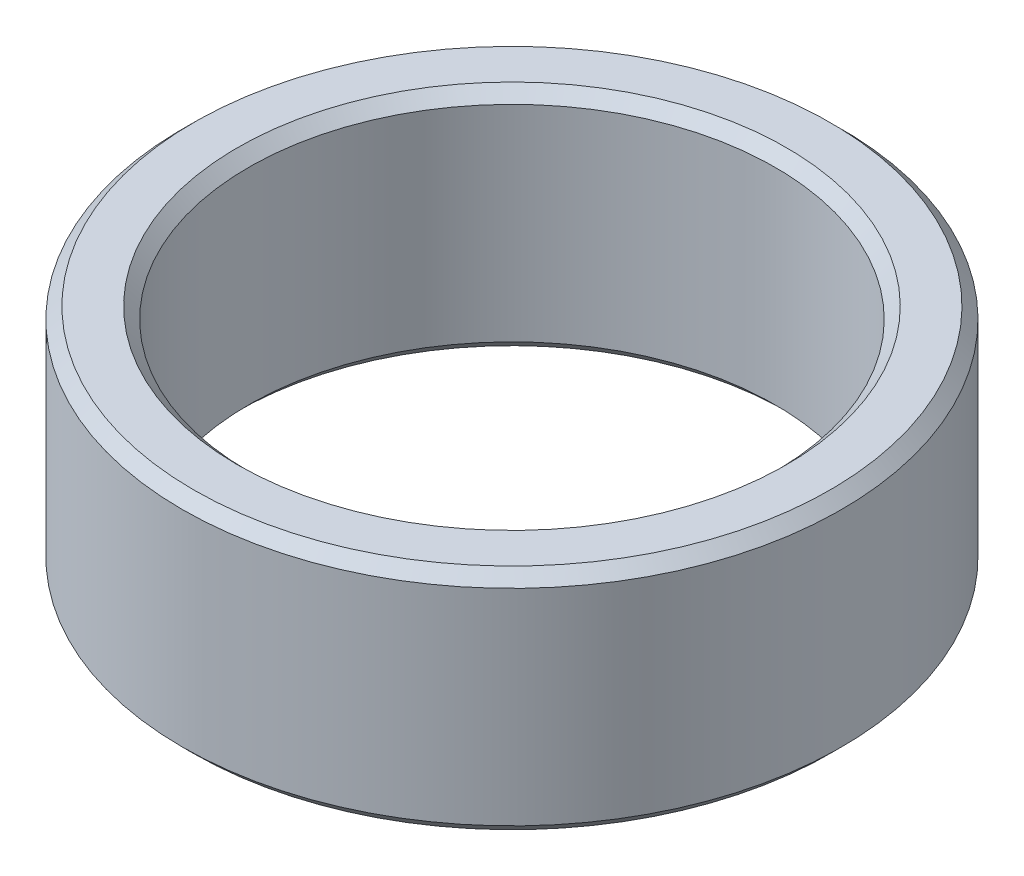
ISO-10303-21;
HEADER;
FILE_DESCRIPTION(('STEP AP214'),'2;1');
FILE_NAME('part.step','',(''),(''),'','','');
FILE_SCHEMA(('AUTOMOTIVE_DESIGN { 1 0 10303 214 1 1 1 1 }'));
ENDSEC;
DATA;
#1=APPLICATION_CONTEXT('core data for automotive mechanical design processes');
#2=APPLICATION_PROTOCOL_DEFINITION('international standard','automotive_design',2000,#1);
#3=PRODUCT_CONTEXT('',#1,'mechanical');
#4=PRODUCT('Part','Part','',(#3));
#5=PRODUCT_RELATED_PRODUCT_CATEGORY('part','',(#4));
#6=PRODUCT_DEFINITION_FORMATION('','',#4);
#7=PRODUCT_DEFINITION_CONTEXT('part definition',#1,'design');
#8=PRODUCT_DEFINITION('design','',#6,#7);
#9=PRODUCT_DEFINITION_SHAPE('','',#8);
#10=(LENGTH_UNIT() NAMED_UNIT(*) SI_UNIT(.MILLI.,.METRE.));
#11=(NAMED_UNIT(*) PLANE_ANGLE_UNIT() SI_UNIT($,.RADIAN.));
#12=(NAMED_UNIT(*) SI_UNIT($,.STERADIAN.) SOLID_ANGLE_UNIT());
#13=UNCERTAINTY_MEASURE_WITH_UNIT(LENGTH_MEASURE(1.E-05),#10,'distance_accuracy_value','');
#14=(GEOMETRIC_REPRESENTATION_CONTEXT(3) GLOBAL_UNCERTAINTY_ASSIGNED_CONTEXT((#13)) GLOBAL_UNIT_ASSIGNED_CONTEXT((#10,
#11,#12)) REPRESENTATION_CONTEXT('',''));
#15=CARTESIAN_POINT('',(0.,0.,0.));
#16=DIRECTION('',(0.,0.,1.));
#17=DIRECTION('',(1.,0.,0.));
#18=AXIS2_PLACEMENT_3D('',#15,#16,#17);
#19=CARTESIAN_POINT('',(0.,34.6418154379135,0.));
#20=DIRECTION('',(0.,-1.,0.));
#21=DIRECTION('',(0.,0.,-1.));
#22=AXIS2_PLACEMENT_3D('',#19,#20,#21);
#23=CYLINDRICAL_SURFACE('',#22,50.);
#24=CARTESIAN_POINT('',(0.,1.71874380042932,0.));
#25=DIRECTION('',(0.,1.,0.));
#26=DIRECTION('',(0.,0.,1.));
#27=AXIS2_PLACEMENT_3D('',#24,#25,#26);
#28=CIRCLE('',#27,50.);
#29=CARTESIAN_POINT('',(0.,1.71874380042932,50.));
#30=VERTEX_POINT('',#29);
#31=EDGE_CURVE('E10',#30,#30,#28,.T.);
#32=ORIENTED_EDGE('',*,*,#31,.T.);
#33=EDGE_LOOP('',(#32));
#34=FACE_BOUND('',#33,.T.);
#35=CARTESIAN_POINT('',(0.,32.9230716374841,0.));
#36=DIRECTION('',(0.,1.,0.));
#37=DIRECTION('',(0.,0.,1.));
#38=AXIS2_PLACEMENT_3D('',#35,#36,#37);
#39=CIRCLE('',#38,50.);
#40=CARTESIAN_POINT('',(0.,32.9230716374841,50.));
#41=VERTEX_POINT('',#40);
#42=EDGE_CURVE('E50',#41,#41,#39,.F.);
#43=ORIENTED_EDGE('',*,*,#42,.T.);
#44=EDGE_LOOP('',(#43));
#45=FACE_BOUND('',#44,.T.);
#46=ADVANCED_FACE('F39',(#34,#45),#23,.T.);
#47=CARTESIAN_POINT('',(0.,34.6418154379135,0.));
#48=DIRECTION('',(0.,1.,0.));
#49=DIRECTION('',(0.,0.,1.));
#50=AXIS2_PLACEMENT_3D('',#47,#48,#49);
#51=PLANE('',#50);
#52=CARTESIAN_POINT('',(0.,34.6418154379135,0.));
#53=DIRECTION('',(0.,1.,0.));
#54=DIRECTION('',(0.,0.,1.));
#55=AXIS2_PLACEMENT_3D('',#52,#53,#54);
#56=CIRCLE('',#55,41.6600283417874);
#57=CARTESIAN_POINT('',(0.,34.6418154379135,41.6600283417874));
#58=VERTEX_POINT('',#57);
#59=EDGE_CURVE('E58',#58,#58,#56,.F.);
#60=ORIENTED_EDGE('',*,*,#59,.T.);
#61=EDGE_LOOP('',(#60));
#62=FACE_BOUND('',#61,.T.);
#63=CARTESIAN_POINT('',(0.,34.6418154379135,0.));
#64=DIRECTION('',(0.,1.,0.));
#65=DIRECTION('',(0.,0.,1.));
#66=AXIS2_PLACEMENT_3D('',#63,#64,#65);
#67=CIRCLE('',#66,48.2812561995706);
#68=CARTESIAN_POINT('',(0.,34.6418154379135,48.2812561995706));
#69=VERTEX_POINT('',#68);
#70=EDGE_CURVE('E61',#69,#69,#67,.T.);
#71=ORIENTED_EDGE('',*,*,#70,.T.);
#72=EDGE_LOOP('',(#71));
#73=FACE_BOUND('',#72,.T.);
#74=ADVANCED_FACE('F88',(#62,#73),#51,.T.);
#75=CARTESIAN_POINT('',(0.,0.,0.));
#76=DIRECTION('',(0.,1.,0.));
#77=DIRECTION('',(0.,0.,1.));
#78=AXIS2_PLACEMENT_3D('',#75,#76,#77);
#79=PLANE('',#78);
#80=CARTESIAN_POINT('',(0.,0.,0.));
#81=DIRECTION('',(0.,1.,0.));
#82=DIRECTION('',(0.,0.,1.));
#83=AXIS2_PLACEMENT_3D('',#80,#81,#82);
#84=CIRCLE('',#83,41.6600283417873);
#85=CARTESIAN_POINT('',(0.,0.,41.6600283417873));
#86=VERTEX_POINT('',#85);
#87=EDGE_CURVE('E51',#86,#86,#84,.T.);
#88=ORIENTED_EDGE('',*,*,#87,.T.);
#89=EDGE_LOOP('',(#88));
#90=FACE_BOUND('',#89,.T.);
#91=CARTESIAN_POINT('',(0.,0.,0.));
#92=DIRECTION('',(0.,1.,0.));
#93=DIRECTION('',(0.,0.,1.));
#94=AXIS2_PLACEMENT_3D('',#91,#92,#93);
#95=CIRCLE('',#94,48.2812561995707);
#96=CARTESIAN_POINT('',(0.,0.,48.2812561995707));
#97=VERTEX_POINT('',#96);
#98=EDGE_CURVE('E54',#97,#97,#95,.F.);
#99=ORIENTED_EDGE('',*,*,#98,.T.);
#100=EDGE_LOOP('',(#99));
#101=FACE_BOUND('',#100,.T.);
#102=ADVANCED_FACE('F83',(#90,#101),#79,.F.);
#103=CARTESIAN_POINT('',(0.,34.6418154379135,0.));
#104=DIRECTION('',(0.,-1.,0.));
#105=DIRECTION('',(0.,0.,-1.));
#106=AXIS2_PLACEMENT_3D('',#103,#104,#105);
#107=CYLINDRICAL_SURFACE('',#106,39.9412845413579);
#108=CARTESIAN_POINT('',(0.,32.9230716374841,0.));
#109=DIRECTION('',(0.,1.,0.));
#110=DIRECTION('',(0.,0.,1.));
#111=AXIS2_PLACEMENT_3D('',#108,#109,#110);
#112=CIRCLE('',#111,39.9412845413579);
#113=CARTESIAN_POINT('',(0.,32.9230716374841,39.9412845413579));
#114=VERTEX_POINT('',#113);
#115=EDGE_CURVE('E67',#114,#114,#112,.T.);
#116=ORIENTED_EDGE('',*,*,#115,.T.);
#117=EDGE_LOOP('',(#116));
#118=FACE_BOUND('',#117,.T.);
#119=CARTESIAN_POINT('',(0.,1.71874380042935,0.));
#120=DIRECTION('',(0.,1.,0.));
#121=DIRECTION('',(0.,0.,1.));
#122=AXIS2_PLACEMENT_3D('',#119,#120,#121);
#123=CIRCLE('',#122,39.9412845413579);
#124=CARTESIAN_POINT('',(0.,1.71874380042935,39.9412845413579));
#125=VERTEX_POINT('',#124);
#126=EDGE_CURVE('E69',#125,#125,#123,.F.);
#127=ORIENTED_EDGE('',*,*,#126,.T.);
#128=EDGE_LOOP('',(#127));
#129=FACE_BOUND('',#128,.T.);
#130=ADVANCED_FACE('F71',(#118,#129),#107,.F.);
#131=CARTESIAN_POINT('',(0.,32.9230716374841,0.));
#132=DIRECTION('',(0.,1.,0.));
#133=DIRECTION('',(0.,0.,1.));
#134=AXIS2_PLACEMENT_3D('',#131,#132,#133);
#135=CONICAL_SURFACE('',#134,39.9412845413579,0.785398163397458);
#136=ORIENTED_EDGE('',*,*,#59,.F.);
#137=EDGE_LOOP('',(#136));
#138=FACE_BOUND('',#137,.T.);
#139=ORIENTED_EDGE('',*,*,#115,.F.);
#140=EDGE_LOOP('',(#139));
#141=FACE_BOUND('',#140,.T.);
#142=ADVANCED_FACE('F77',(#138,#141),#135,.F.);
#143=CARTESIAN_POINT('',(0.,0.,0.));
#144=DIRECTION('',(0.,-1.,0.));
#145=DIRECTION('',(0.,0.,-1.));
#146=AXIS2_PLACEMENT_3D('',#143,#144,#145);
#147=CONICAL_SURFACE('',#146,41.6600283417873,0.785398163397442);
#148=ORIENTED_EDGE('',*,*,#126,.F.);
#149=EDGE_LOOP('',(#148));
#150=FACE_BOUND('',#149,.T.);
#151=ORIENTED_EDGE('',*,*,#87,.F.);
#152=EDGE_LOOP('',(#151));
#153=FACE_BOUND('',#152,.T.);
#154=ADVANCED_FACE('F73',(#150,#153),#147,.F.);
#155=CARTESIAN_POINT('',(0.,1.71874380042932,0.));
#156=DIRECTION('',(0.,1.,0.));
#157=DIRECTION('',(0.,0.,1.));
#158=AXIS2_PLACEMENT_3D('',#155,#156,#157);
#159=CONICAL_SURFACE('',#158,50.,0.785398163397452);
#160=ORIENTED_EDGE('',*,*,#98,.F.);
#161=EDGE_LOOP('',(#160));
#162=FACE_BOUND('',#161,.T.);
#163=ORIENTED_EDGE('',*,*,#31,.F.);
#164=EDGE_LOOP('',(#163));
#165=FACE_BOUND('',#164,.T.);
#166=ADVANCED_FACE('F76',(#162,#165),#159,.T.);
#167=CARTESIAN_POINT('',(0.,34.6418154379135,0.));
#168=DIRECTION('',(0.,-1.,0.));
#169=DIRECTION('',(0.,0.,-1.));
#170=AXIS2_PLACEMENT_3D('',#167,#168,#169);
#171=CONICAL_SURFACE('',#170,48.2812561995706,0.785398163397442);
#172=ORIENTED_EDGE('',*,*,#42,.F.);
#173=EDGE_LOOP('',(#172));
#174=FACE_BOUND('',#173,.T.);
#175=ORIENTED_EDGE('',*,*,#70,.F.);
#176=EDGE_LOOP('',(#175));
#177=FACE_BOUND('',#176,.T.);
#178=ADVANCED_FACE('F45',(#174,#177),#171,.T.);
#179=CLOSED_SHELL('',(#46,#74,#102,#130,#142,#154,#166,#178));
#180=MANIFOLD_SOLID_BREP('B2',#179);
#181=ADVANCED_BREP_SHAPE_REPRESENTATION('',(#18,#180),#14);
#182=SHAPE_DEFINITION_REPRESENTATION(#9,#181);
ENDSEC;
END-ISO-10303-21;
